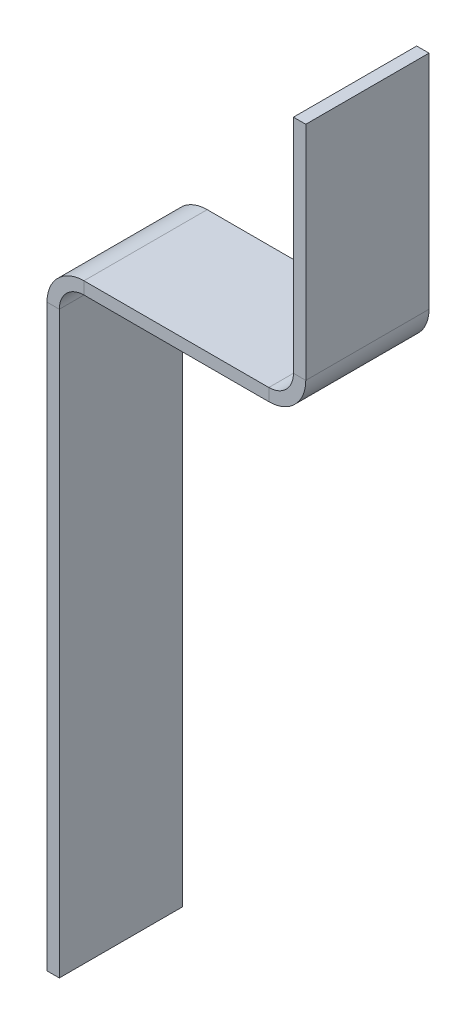
ISO-10303-21;
HEADER;
FILE_DESCRIPTION(('STEP AP214'),'2;1');
FILE_NAME('part.step','',(''),(''),'','','');
FILE_SCHEMA(('AUTOMOTIVE_DESIGN { 1 0 10303 214 1 1 1 1 }'));
ENDSEC;
DATA;
#1=APPLICATION_CONTEXT('core data for automotive mechanical design processes');
#2=APPLICATION_PROTOCOL_DEFINITION('international standard','automotive_design',2000,#1);
#3=PRODUCT_CONTEXT('',#1,'mechanical');
#4=PRODUCT('Part','Part','',(#3));
#5=PRODUCT_RELATED_PRODUCT_CATEGORY('part','',(#4));
#6=PRODUCT_DEFINITION_FORMATION('','',#4);
#7=PRODUCT_DEFINITION_CONTEXT('part definition',#1,'design');
#8=PRODUCT_DEFINITION('design','',#6,#7);
#9=PRODUCT_DEFINITION_SHAPE('','',#8);
#10=(LENGTH_UNIT() NAMED_UNIT(*) SI_UNIT(.MILLI.,.METRE.));
#11=(NAMED_UNIT(*) PLANE_ANGLE_UNIT() SI_UNIT($,.RADIAN.));
#12=(NAMED_UNIT(*) SI_UNIT($,.STERADIAN.) SOLID_ANGLE_UNIT());
#13=UNCERTAINTY_MEASURE_WITH_UNIT(LENGTH_MEASURE(1.E-05),#10,'distance_accuracy_value','');
#14=(GEOMETRIC_REPRESENTATION_CONTEXT(3) GLOBAL_UNCERTAINTY_ASSIGNED_CONTEXT((#13)) GLOBAL_UNIT_ASSIGNED_CONTEXT((#10,
#11,#12)) REPRESENTATION_CONTEXT('',''));
#15=CARTESIAN_POINT('',(0.,0.,0.));
#16=DIRECTION('',(0.,0.,1.));
#17=DIRECTION('',(1.,0.,0.));
#18=AXIS2_PLACEMENT_3D('',#15,#16,#17);
#19=CARTESIAN_POINT('',(0.,49.,5.));
#20=DIRECTION('',(0.,1.,0.));
#21=DIRECTION('',(0.,0.,1.));
#22=AXIS2_PLACEMENT_3D('',#19,#20,#21);
#23=PLANE('',#22);
#24=DIRECTION('',(0.,0.,-1.));
#25=VECTOR('',#24,1.);
#26=CARTESIAN_POINT('',(18.,49.,-5.));
#27=LINE('',#26,#25);
#28=CARTESIAN_POINT('',(18.,49.,-5.));
#29=VERTEX_POINT('',#28);
#30=CARTESIAN_POINT('',(18.,49.,5.));
#31=VERTEX_POINT('',#30);
#32=EDGE_CURVE('E54',#29,#31,#27,.F.);
#33=ORIENTED_EDGE('',*,*,#32,.T.);
#34=DIRECTION('',(1.,0.,0.));
#35=VECTOR('',#34,1.);
#36=CARTESIAN_POINT('',(0.,49.,5.));
#37=LINE('',#36,#35);
#38=CARTESIAN_POINT('',(3.,49.,5.));
#39=VERTEX_POINT('',#38);
#40=EDGE_CURVE('E192',#39,#31,#37,.T.);
#41=ORIENTED_EDGE('',*,*,#40,.F.);
#42=DIRECTION('',(0.,0.,-1.));
#43=VECTOR('',#42,1.);
#44=CARTESIAN_POINT('',(3.,49.,5.));
#45=LINE('',#44,#43);
#46=CARTESIAN_POINT('',(3.,49.,-5.));
#47=VERTEX_POINT('',#46);
#48=EDGE_CURVE('E212',#39,#47,#45,.T.);
#49=ORIENTED_EDGE('',*,*,#48,.T.);
#50=DIRECTION('',(1.,0.,0.));
#51=VECTOR('',#50,1.);
#52=CARTESIAN_POINT('',(0.,49.,-5.));
#53=LINE('',#52,#51);
#54=EDGE_CURVE('E189',#47,#29,#53,.T.);
#55=ORIENTED_EDGE('',*,*,#54,.T.);
#56=EDGE_LOOP('',(#33,#41,#49,#55));
#57=FACE_BOUND('',#56,.T.);
#58=ADVANCED_FACE('F39',(#57),#23,.F.);
#59=CARTESIAN_POINT('',(0.,50.,5.));
#60=DIRECTION('',(0.,1.,0.));
#61=DIRECTION('',(0.,0.,1.));
#62=AXIS2_PLACEMENT_3D('',#59,#60,#61);
#63=PLANE('',#62);
#64=DIRECTION('',(1.,0.,0.));
#65=VECTOR('',#64,1.);
#66=CARTESIAN_POINT('',(0.,50.,5.));
#67=LINE('',#66,#65);
#68=CARTESIAN_POINT('',(3.,50.,5.));
#69=VERTEX_POINT('',#68);
#70=CARTESIAN_POINT('',(18.,50.,5.));
#71=VERTEX_POINT('',#70);
#72=EDGE_CURVE('E194',#69,#71,#67,.T.);
#73=ORIENTED_EDGE('',*,*,#72,.T.);
#74=DIRECTION('',(0.,0.,-1.));
#75=VECTOR('',#74,1.);
#76=CARTESIAN_POINT('',(18.,50.,-5.));
#77=LINE('',#76,#75);
#78=CARTESIAN_POINT('',(18.,50.,-5.));
#79=VERTEX_POINT('',#78);
#80=EDGE_CURVE('E184',#79,#71,#77,.F.);
#81=ORIENTED_EDGE('',*,*,#80,.F.);
#82=DIRECTION('',(1.,0.,0.));
#83=VECTOR('',#82,1.);
#84=CARTESIAN_POINT('',(0.,50.,-5.));
#85=LINE('',#84,#83);
#86=CARTESIAN_POINT('',(3.,50.,-5.));
#87=VERTEX_POINT('',#86);
#88=EDGE_CURVE('E214',#87,#79,#85,.T.);
#89=ORIENTED_EDGE('',*,*,#88,.F.);
#90=DIRECTION('',(0.,0.,-1.));
#91=VECTOR('',#90,1.);
#92=CARTESIAN_POINT('',(3.,50.,5.));
#93=LINE('',#92,#91);
#94=EDGE_CURVE('E242',#69,#87,#93,.T.);
#95=ORIENTED_EDGE('',*,*,#94,.F.);
#96=EDGE_LOOP('',(#73,#81,#89,#95));
#97=FACE_BOUND('',#96,.T.);
#98=ADVANCED_FACE('F304',(#97),#63,.T.);
#99=CARTESIAN_POINT('',(3.,47.,-5.));
#100=DIRECTION('',(0.,0.,1.));
#101=DIRECTION('',(1.,0.,0.));
#102=AXIS2_PLACEMENT_3D('',#99,#100,#101);
#103=PLANE('',#102);
#104=DIRECTION('',(0.,-1.,0.));
#105=VECTOR('',#104,1.);
#106=CARTESIAN_POINT('',(18.,50.,-5.));
#107=LINE('',#106,#105);
#108=EDGE_CURVE('E180',#79,#29,#107,.T.);
#109=ORIENTED_EDGE('',*,*,#108,.T.);
#110=ORIENTED_EDGE('',*,*,#54,.F.);
#111=DIRECTION('',(0.,1.,0.));
#112=VECTOR('',#111,1.);
#113=CARTESIAN_POINT('',(3.,49.,-5.));
#114=LINE('',#113,#112);
#115=EDGE_CURVE('E245',#47,#87,#114,.T.);
#116=ORIENTED_EDGE('',*,*,#115,.T.);
#117=ORIENTED_EDGE('',*,*,#88,.T.);
#118=EDGE_LOOP('',(#109,#110,#116,#117));
#119=FACE_BOUND('',#118,.T.);
#120=ADVANCED_FACE('F309',(#119),#103,.F.);
#121=CARTESIAN_POINT('',(3.,50.,5.));
#122=DIRECTION('',(0.,0.,1.));
#123=DIRECTION('',(1.,0.,0.));
#124=AXIS2_PLACEMENT_3D('',#121,#122,#123);
#125=PLANE('',#124);
#126=DIRECTION('',(0.,-1.,0.));
#127=VECTOR('',#126,1.);
#128=CARTESIAN_POINT('',(3.,50.,5.));
#129=LINE('',#128,#127);
#130=EDGE_CURVE('E11',#69,#39,#129,.T.);
#131=ORIENTED_EDGE('',*,*,#130,.F.);
#132=CARTESIAN_POINT('',(3.,47.,5.));
#133=DIRECTION('',(0.,0.,1.));
#134=DIRECTION('',(1.,0.,0.));
#135=AXIS2_PLACEMENT_3D('',#132,#133,#134);
#136=CIRCLE('',#135,3.);
#137=CARTESIAN_POINT('',(0.,47.,5.));
#138=VERTEX_POINT('',#137);
#139=EDGE_CURVE('E197',#138,#69,#136,.F.);
#140=ORIENTED_EDGE('',*,*,#139,.F.);
#141=DIRECTION('',(-1.,0.,0.));
#142=VECTOR('',#141,1.);
#143=CARTESIAN_POINT('',(1.,47.,5.));
#144=LINE('',#143,#142);
#145=CARTESIAN_POINT('',(1.,47.,5.));
#146=VERTEX_POINT('',#145);
#147=EDGE_CURVE('E47',#146,#138,#144,.T.);
#148=ORIENTED_EDGE('',*,*,#147,.F.);
#149=CARTESIAN_POINT('',(3.,47.,5.));
#150=DIRECTION('',(0.,0.,1.));
#151=DIRECTION('',(1.,0.,0.));
#152=AXIS2_PLACEMENT_3D('',#149,#150,#151);
#153=CIRCLE('',#152,2.);
#154=EDGE_CURVE('E209',#146,#39,#153,.F.);
#155=ORIENTED_EDGE('',*,*,#154,.T.);
#156=EDGE_LOOP('',(#131,#140,#148,#155));
#157=FACE_BOUND('',#156,.T.);
#158=ADVANCED_FACE('F41',(#157),#125,.T.);
#159=CARTESIAN_POINT('',(1.,47.,5.));
#160=DIRECTION('',(0.,0.,1.));
#161=DIRECTION('',(1.,0.,0.));
#162=AXIS2_PLACEMENT_3D('',#159,#160,#161);
#163=PLANE('',#162);
#164=DIRECTION('',(0.,-1.,0.));
#165=VECTOR('',#164,1.);
#166=CARTESIAN_POINT('',(18.,50.,5.));
#167=LINE('',#166,#165);
#168=EDGE_CURVE('E61',#71,#31,#167,.T.);
#169=ORIENTED_EDGE('',*,*,#168,.F.);
#170=ORIENTED_EDGE('',*,*,#72,.F.);
#171=ORIENTED_EDGE('',*,*,#130,.T.);
#172=ORIENTED_EDGE('',*,*,#40,.T.);
#173=EDGE_LOOP('',(#169,#170,#171,#172));
#174=FACE_BOUND('',#173,.T.);
#175=ADVANCED_FACE('F276',(#174),#163,.T.);
#176=CARTESIAN_POINT('',(0.,47.,-5.));
#177=DIRECTION('',(0.,0.,-1.));
#178=DIRECTION('',(-1.,0.,0.));
#179=AXIS2_PLACEMENT_3D('',#176,#177,#178);
#180=PLANE('',#179);
#181=DIRECTION('',(1.,0.,0.));
#182=VECTOR('',#181,1.);
#183=CARTESIAN_POINT('',(0.,47.,-5.));
#184=LINE('',#183,#182);
#185=CARTESIAN_POINT('',(0.,47.,-5.));
#186=VERTEX_POINT('',#185);
#187=CARTESIAN_POINT('',(1.,47.,-5.));
#188=VERTEX_POINT('',#187);
#189=EDGE_CURVE('E247',#186,#188,#184,.T.);
#190=ORIENTED_EDGE('',*,*,#189,.F.);
#191=CARTESIAN_POINT('',(3.,47.,-5.));
#192=DIRECTION('',(0.,0.,1.));
#193=DIRECTION('',(1.,0.,0.));
#194=AXIS2_PLACEMENT_3D('',#191,#192,#193);
#195=CIRCLE('',#194,3.);
#196=EDGE_CURVE('E216',#186,#87,#195,.F.);
#197=ORIENTED_EDGE('',*,*,#196,.T.);
#198=ORIENTED_EDGE('',*,*,#115,.F.);
#199=CARTESIAN_POINT('',(3.,47.,-5.));
#200=DIRECTION('',(0.,0.,1.));
#201=DIRECTION('',(1.,0.,0.));
#202=AXIS2_PLACEMENT_3D('',#199,#200,#201);
#203=CIRCLE('',#202,2.);
#204=EDGE_CURVE('E195',#188,#47,#203,.F.);
#205=ORIENTED_EDGE('',*,*,#204,.F.);
#206=EDGE_LOOP('',(#190,#197,#198,#205));
#207=FACE_BOUND('',#206,.T.);
#208=ADVANCED_FACE('F317',(#207),#180,.T.);
#209=CARTESIAN_POINT('',(3.,49.,-5.));
#210=DIRECTION('',(0.,0.,-1.));
#211=DIRECTION('',(-1.,0.,0.));
#212=AXIS2_PLACEMENT_3D('',#209,#210,#211);
#213=PLANE('',#212);
#214=DIRECTION('',(0.,1.,0.));
#215=VECTOR('',#214,1.);
#216=CARTESIAN_POINT('',(0.,0.,-5.));
#217=LINE('',#216,#215);
#218=CARTESIAN_POINT('',(0.,0.,-5.));
#219=VERTEX_POINT('',#218);
#220=EDGE_CURVE('E219',#219,#186,#217,.T.);
#221=ORIENTED_EDGE('',*,*,#220,.T.);
#222=ORIENTED_EDGE('',*,*,#189,.T.);
#223=DIRECTION('',(0.,1.,0.));
#224=VECTOR('',#223,1.);
#225=CARTESIAN_POINT('',(1.,0.,-5.));
#226=LINE('',#225,#224);
#227=CARTESIAN_POINT('',(1.,0.,-5.));
#228=VERTEX_POINT('',#227);
#229=EDGE_CURVE('E225',#228,#188,#226,.T.);
#230=ORIENTED_EDGE('',*,*,#229,.F.);
#231=DIRECTION('',(-1.,0.,0.));
#232=VECTOR('',#231,1.);
#233=CARTESIAN_POINT('',(1.,0.,-5.));
#234=LINE('',#233,#232);
#235=EDGE_CURVE('E222',#228,#219,#234,.T.);
#236=ORIENTED_EDGE('',*,*,#235,.T.);
#237=EDGE_LOOP('',(#221,#222,#230,#236));
#238=FACE_BOUND('',#237,.T.);
#239=ADVANCED_FACE('F314',(#238),#213,.T.);
#240=CARTESIAN_POINT('',(3.,47.,5.));
#241=DIRECTION('',(0.,0.,-1.));
#242=DIRECTION('',(-1.,0.,0.));
#243=AXIS2_PLACEMENT_3D('',#240,#241,#242);
#244=CYLINDRICAL_SURFACE('',#243,3.);
#245=ORIENTED_EDGE('',*,*,#196,.F.);
#246=DIRECTION('',(0.,0.,-1.));
#247=VECTOR('',#246,1.);
#248=CARTESIAN_POINT('',(0.,47.,5.));
#249=LINE('',#248,#247);
#250=EDGE_CURVE('E239',#138,#186,#249,.T.);
#251=ORIENTED_EDGE('',*,*,#250,.F.);
#252=ORIENTED_EDGE('',*,*,#139,.T.);
#253=ORIENTED_EDGE('',*,*,#94,.T.);
#254=EDGE_LOOP('',(#245,#251,#252,#253));
#255=FACE_BOUND('',#254,.T.);
#256=ADVANCED_FACE('F259',(#255),#244,.T.);
#257=CARTESIAN_POINT('',(0.,0.,5.));
#258=DIRECTION('',(-1.,0.,0.));
#259=DIRECTION('',(0.,0.,1.));
#260=AXIS2_PLACEMENT_3D('',#257,#258,#259);
#261=PLANE('',#260);
#262=ORIENTED_EDGE('',*,*,#220,.F.);
#263=DIRECTION('',(0.,0.,-1.));
#264=VECTOR('',#263,1.);
#265=CARTESIAN_POINT('',(0.,0.,5.));
#266=LINE('',#265,#264);
#267=CARTESIAN_POINT('',(0.,0.,5.));
#268=VERTEX_POINT('',#267);
#269=EDGE_CURVE('E237',#268,#219,#266,.T.);
#270=ORIENTED_EDGE('',*,*,#269,.F.);
#271=DIRECTION('',(0.,1.,0.));
#272=VECTOR('',#271,1.);
#273=CARTESIAN_POINT('',(0.,0.,5.));
#274=LINE('',#273,#272);
#275=EDGE_CURVE('E200',#268,#138,#274,.T.);
#276=ORIENTED_EDGE('',*,*,#275,.T.);
#277=ORIENTED_EDGE('',*,*,#250,.T.);
#278=EDGE_LOOP('',(#262,#270,#276,#277));
#279=FACE_BOUND('',#278,.T.);
#280=ADVANCED_FACE('F263',(#279),#261,.T.);
#281=CARTESIAN_POINT('',(1.,0.,5.));
#282=DIRECTION('',(0.,-1.,0.));
#283=DIRECTION('',(0.,0.,-1.));
#284=AXIS2_PLACEMENT_3D('',#281,#282,#283);
#285=PLANE('',#284);
#286=ORIENTED_EDGE('',*,*,#235,.F.);
#287=DIRECTION('',(0.,0.,-1.));
#288=VECTOR('',#287,1.);
#289=CARTESIAN_POINT('',(1.,0.,5.));
#290=LINE('',#289,#288);
#291=CARTESIAN_POINT('',(1.,0.,5.));
#292=VERTEX_POINT('',#291);
#293=EDGE_CURVE('E235',#292,#228,#290,.T.);
#294=ORIENTED_EDGE('',*,*,#293,.F.);
#295=DIRECTION('',(-1.,0.,0.));
#296=VECTOR('',#295,1.);
#297=CARTESIAN_POINT('',(1.,0.,5.));
#298=LINE('',#297,#296);
#299=EDGE_CURVE('E203',#292,#268,#298,.T.);
#300=ORIENTED_EDGE('',*,*,#299,.T.);
#301=ORIENTED_EDGE('',*,*,#269,.T.);
#302=EDGE_LOOP('',(#286,#294,#300,#301));
#303=FACE_BOUND('',#302,.T.);
#304=ADVANCED_FACE('F266',(#303),#285,.T.);
#305=CARTESIAN_POINT('',(1.,0.,5.));
#306=DIRECTION('',(-1.,0.,0.));
#307=DIRECTION('',(0.,0.,1.));
#308=AXIS2_PLACEMENT_3D('',#305,#306,#307);
#309=PLANE('',#308);
#310=ORIENTED_EDGE('',*,*,#229,.T.);
#311=DIRECTION('',(0.,0.,-1.));
#312=VECTOR('',#311,1.);
#313=CARTESIAN_POINT('',(1.,47.,5.));
#314=LINE('',#313,#312);
#315=EDGE_CURVE('E232',#146,#188,#314,.T.);
#316=ORIENTED_EDGE('',*,*,#315,.F.);
#317=DIRECTION('',(0.,1.,0.));
#318=VECTOR('',#317,1.);
#319=CARTESIAN_POINT('',(1.,0.,5.));
#320=LINE('',#319,#318);
#321=EDGE_CURVE('E206',#292,#146,#320,.T.);
#322=ORIENTED_EDGE('',*,*,#321,.F.);
#323=ORIENTED_EDGE('',*,*,#293,.T.);
#324=EDGE_LOOP('',(#310,#316,#322,#323));
#325=FACE_BOUND('',#324,.T.);
#326=ADVANCED_FACE('F269',(#325),#309,.F.);
#327=CARTESIAN_POINT('',(3.,47.,5.));
#328=DIRECTION('',(0.,0.,-1.));
#329=DIRECTION('',(-1.,0.,0.));
#330=AXIS2_PLACEMENT_3D('',#327,#328,#329);
#331=CYLINDRICAL_SURFACE('',#330,2.);
#332=ORIENTED_EDGE('',*,*,#204,.T.);
#333=ORIENTED_EDGE('',*,*,#48,.F.);
#334=ORIENTED_EDGE('',*,*,#154,.F.);
#335=ORIENTED_EDGE('',*,*,#315,.T.);
#336=EDGE_LOOP('',(#332,#333,#334,#335));
#337=FACE_BOUND('',#336,.T.);
#338=ADVANCED_FACE('F274',(#337),#331,.F.);
#339=CARTESIAN_POINT('',(3.,47.,5.));
#340=DIRECTION('',(0.,0.,1.));
#341=DIRECTION('',(1.,0.,0.));
#342=AXIS2_PLACEMENT_3D('',#339,#340,#341);
#343=PLANE('',#342);
#344=ORIENTED_EDGE('',*,*,#321,.T.);
#345=ORIENTED_EDGE('',*,*,#147,.T.);
#346=ORIENTED_EDGE('',*,*,#275,.F.);
#347=ORIENTED_EDGE('',*,*,#299,.F.);
#348=EDGE_LOOP('',(#344,#345,#346,#347));
#349=FACE_BOUND('',#348,.T.);
#350=ADVANCED_FACE('F251',(#349),#343,.T.);
#351=CARTESIAN_POINT('',(18.,52.,5.));
#352=DIRECTION('',(0.,0.,1.));
#353=DIRECTION('',(1.,0.,0.));
#354=AXIS2_PLACEMENT_3D('',#351,#352,#353);
#355=PLANE('',#354);
#356=DIRECTION('',(1.,0.,0.));
#357=VECTOR('',#356,1.);
#358=CARTESIAN_POINT('',(20.,52.,5.));
#359=LINE('',#358,#357);
#360=CARTESIAN_POINT('',(20.,52.,5.));
#361=VERTEX_POINT('',#360);
#362=CARTESIAN_POINT('',(21.,52.,5.));
#363=VERTEX_POINT('',#362);
#364=EDGE_CURVE('E281',#361,#363,#359,.T.);
#365=ORIENTED_EDGE('',*,*,#364,.F.);
#366=CARTESIAN_POINT('',(18.,52.,5.));
#367=DIRECTION('',(0.,0.,-1.));
#368=DIRECTION('',(-1.,0.,0.));
#369=AXIS2_PLACEMENT_3D('',#366,#367,#368);
#370=CIRCLE('',#369,2.);
#371=EDGE_CURVE('E137',#71,#361,#370,.F.);
#372=ORIENTED_EDGE('',*,*,#371,.F.);
#373=ORIENTED_EDGE('',*,*,#168,.T.);
#374=CARTESIAN_POINT('',(18.,52.,5.));
#375=DIRECTION('',(0.,0.,-1.));
#376=DIRECTION('',(-1.,0.,0.));
#377=AXIS2_PLACEMENT_3D('',#374,#375,#376);
#378=CIRCLE('',#377,3.);
#379=EDGE_CURVE('E179',#31,#363,#378,.F.);
#380=ORIENTED_EDGE('',*,*,#379,.T.);
#381=EDGE_LOOP('',(#365,#372,#373,#380));
#382=FACE_BOUND('',#381,.T.);
#383=ADVANCED_FACE('F279',(#382),#355,.T.);
#384=CARTESIAN_POINT('',(18.,52.,-5.));
#385=DIRECTION('',(0.,0.,1.));
#386=DIRECTION('',(1.,0.,0.));
#387=AXIS2_PLACEMENT_3D('',#384,#385,#386);
#388=PLANE('',#387);
#389=CARTESIAN_POINT('',(18.,52.,-5.));
#390=DIRECTION('',(0.,0.,-1.));
#391=DIRECTION('',(-1.,0.,0.));
#392=AXIS2_PLACEMENT_3D('',#389,#390,#391);
#393=CIRCLE('',#392,2.);
#394=CARTESIAN_POINT('',(20.,52.,-5.));
#395=VERTEX_POINT('',#394);
#396=EDGE_CURVE('E144',#395,#79,#393,.T.);
#397=ORIENTED_EDGE('',*,*,#396,.F.);
#398=DIRECTION('',(1.,0.,0.));
#399=VECTOR('',#398,1.);
#400=CARTESIAN_POINT('',(20.,52.,-5.));
#401=LINE('',#400,#399);
#402=CARTESIAN_POINT('',(21.,52.,-5.));
#403=VERTEX_POINT('',#402);
#404=EDGE_CURVE('E141',#395,#403,#401,.T.);
#405=ORIENTED_EDGE('',*,*,#404,.T.);
#406=CARTESIAN_POINT('',(18.,52.,-5.));
#407=DIRECTION('',(0.,0.,-1.));
#408=DIRECTION('',(-1.,0.,0.));
#409=AXIS2_PLACEMENT_3D('',#406,#407,#408);
#410=CIRCLE('',#409,3.);
#411=EDGE_CURVE('E128',#403,#29,#410,.T.);
#412=ORIENTED_EDGE('',*,*,#411,.T.);
#413=ORIENTED_EDGE('',*,*,#108,.F.);
#414=EDGE_LOOP('',(#397,#405,#412,#413));
#415=FACE_BOUND('',#414,.T.);
#416=ADVANCED_FACE('F142',(#415),#388,.F.);
#417=CARTESIAN_POINT('',(18.,52.,-5.));
#418=DIRECTION('',(0.,0.,-1.));
#419=DIRECTION('',(1.,0.,0.));
#420=AXIS2_PLACEMENT_3D('',#417,#418,#419);
#421=CYLINDRICAL_SURFACE('',#420,3.);
#422=ORIENTED_EDGE('',*,*,#32,.F.);
#423=ORIENTED_EDGE('',*,*,#411,.F.);
#424=DIRECTION('',(0.,0.,1.));
#425=VECTOR('',#424,1.);
#426=CARTESIAN_POINT('',(21.,52.,0.));
#427=LINE('',#426,#425);
#428=EDGE_CURVE('E133',#403,#363,#427,.T.);
#429=ORIENTED_EDGE('',*,*,#428,.T.);
#430=ORIENTED_EDGE('',*,*,#379,.F.);
#431=EDGE_LOOP('',(#422,#423,#429,#430));
#432=FACE_BOUND('',#431,.T.);
#433=ADVANCED_FACE('F130',(#432),#421,.T.);
#434=CARTESIAN_POINT('',(18.,52.,-5.));
#435=DIRECTION('',(0.,0.,-1.));
#436=DIRECTION('',(1.,0.,0.));
#437=AXIS2_PLACEMENT_3D('',#434,#435,#436);
#438=CYLINDRICAL_SURFACE('',#437,2.);
#439=ORIENTED_EDGE('',*,*,#80,.T.);
#440=ORIENTED_EDGE('',*,*,#371,.T.);
#441=DIRECTION('',(0.,0.,-1.));
#442=VECTOR('',#441,1.);
#443=CARTESIAN_POINT('',(20.,52.,5.));
#444=LINE('',#443,#442);
#445=EDGE_CURVE('E148',#361,#395,#444,.T.);
#446=ORIENTED_EDGE('',*,*,#445,.T.);
#447=ORIENTED_EDGE('',*,*,#396,.T.);
#448=EDGE_LOOP('',(#439,#440,#446,#447));
#449=FACE_BOUND('',#448,.T.);
#450=ADVANCED_FACE('F284',(#449),#438,.F.);
#451=CARTESIAN_POINT('',(21.,50.,5.));
#452=DIRECTION('',(0.,0.,-1.));
#453=DIRECTION('',(0.,1.,0.));
#454=AXIS2_PLACEMENT_3D('',#451,#452,#453);
#455=PLANE('',#454);
#456=ORIENTED_EDGE('',*,*,#364,.T.);
#457=DIRECTION('',(0.,-1.,0.));
#458=VECTOR('',#457,1.);
#459=CARTESIAN_POINT('',(21.,50.,5.));
#460=LINE('',#459,#458);
#461=CARTESIAN_POINT('',(21.0000000000001,70.,5.));
#462=VERTEX_POINT('',#461);
#463=EDGE_CURVE('E156',#462,#363,#460,.T.);
#464=ORIENTED_EDGE('',*,*,#463,.F.);
#465=DIRECTION('',(-1.,0.,0.));
#466=VECTOR('',#465,1.);
#467=CARTESIAN_POINT('',(21.0000000000001,70.,5.));
#468=LINE('',#467,#466);
#469=CARTESIAN_POINT('',(20.0000000000001,70.,5.));
#470=VERTEX_POINT('',#469);
#471=EDGE_CURVE('E165',#462,#470,#468,.T.);
#472=ORIENTED_EDGE('',*,*,#471,.T.);
#473=DIRECTION('',(0.,-1.,0.));
#474=VECTOR('',#473,1.);
#475=CARTESIAN_POINT('',(20.,50.,5.));
#476=LINE('',#475,#474);
#477=EDGE_CURVE('E157',#470,#361,#476,.T.);
#478=ORIENTED_EDGE('',*,*,#477,.T.);
#479=EDGE_LOOP('',(#456,#464,#472,#478));
#480=FACE_BOUND('',#479,.T.);
#481=ADVANCED_FACE('F292',(#480),#455,.F.);
#482=CARTESIAN_POINT('',(21.0000000000001,70.,-5.));
#483=DIRECTION('',(0.,0.,1.));
#484=DIRECTION('',(0.,-1.,0.));
#485=AXIS2_PLACEMENT_3D('',#482,#483,#484);
#486=PLANE('',#485);
#487=ORIENTED_EDGE('',*,*,#404,.F.);
#488=DIRECTION('',(0.,1.,0.));
#489=VECTOR('',#488,1.);
#490=CARTESIAN_POINT('',(20.0000000000001,70.,-5.));
#491=LINE('',#490,#489);
#492=CARTESIAN_POINT('',(20.0000000000001,70.,-5.));
#493=VERTEX_POINT('',#492);
#494=EDGE_CURVE('E172',#395,#493,#491,.T.);
#495=ORIENTED_EDGE('',*,*,#494,.T.);
#496=DIRECTION('',(-1.,0.,0.));
#497=VECTOR('',#496,1.);
#498=CARTESIAN_POINT('',(21.0000000000001,70.,-5.));
#499=LINE('',#498,#497);
#500=CARTESIAN_POINT('',(21.0000000000001,70.,-5.));
#501=VERTEX_POINT('',#500);
#502=EDGE_CURVE('E161',#501,#493,#499,.T.);
#503=ORIENTED_EDGE('',*,*,#502,.F.);
#504=DIRECTION('',(0.,1.,0.));
#505=VECTOR('',#504,1.);
#506=CARTESIAN_POINT('',(21.0000000000001,70.,-5.));
#507=LINE('',#506,#505);
#508=EDGE_CURVE('E153',#403,#501,#507,.T.);
#509=ORIENTED_EDGE('',*,*,#508,.F.);
#510=EDGE_LOOP('',(#487,#495,#503,#509));
#511=FACE_BOUND('',#510,.T.);
#512=ADVANCED_FACE('F159',(#511),#486,.F.);
#513=CARTESIAN_POINT('',(20.9999999999998,0.,0.));
#514=DIRECTION('',(-1.,0.,0.));
#515=DIRECTION('',(0.,-1.,0.));
#516=AXIS2_PLACEMENT_3D('',#513,#514,#515);
#517=PLANE('',#516);
#518=ORIENTED_EDGE('',*,*,#428,.F.);
#519=ORIENTED_EDGE('',*,*,#508,.T.);
#520=DIRECTION('',(0.,0.,1.));
#521=VECTOR('',#520,1.);
#522=CARTESIAN_POINT('',(21.0000000000001,70.,5.));
#523=LINE('',#522,#521);
#524=EDGE_CURVE('E163',#501,#462,#523,.T.);
#525=ORIENTED_EDGE('',*,*,#524,.T.);
#526=ORIENTED_EDGE('',*,*,#463,.T.);
#527=EDGE_LOOP('',(#518,#519,#525,#526));
#528=FACE_BOUND('',#527,.T.);
#529=ADVANCED_FACE('F152',(#528),#517,.F.);
#530=CARTESIAN_POINT('',(19.9999999999998,0.,0.));
#531=DIRECTION('',(-1.,0.,0.));
#532=DIRECTION('',(0.,-1.,0.));
#533=AXIS2_PLACEMENT_3D('',#530,#531,#532);
#534=PLANE('',#533);
#535=ORIENTED_EDGE('',*,*,#494,.F.);
#536=ORIENTED_EDGE('',*,*,#445,.F.);
#537=ORIENTED_EDGE('',*,*,#477,.F.);
#538=DIRECTION('',(0.,0.,1.));
#539=VECTOR('',#538,1.);
#540=CARTESIAN_POINT('',(20.0000000000001,70.,5.));
#541=LINE('',#540,#539);
#542=EDGE_CURVE('E167',#493,#470,#541,.T.);
#543=ORIENTED_EDGE('',*,*,#542,.F.);
#544=EDGE_LOOP('',(#535,#536,#537,#543));
#545=FACE_BOUND('',#544,.T.);
#546=ADVANCED_FACE('F288',(#545),#534,.T.);
#547=CARTESIAN_POINT('',(21.0000000000001,70.,5.));
#548=DIRECTION('',(0.,-1.,0.));
#549=DIRECTION('',(1.,0.,0.));
#550=AXIS2_PLACEMENT_3D('',#547,#548,#549);
#551=PLANE('',#550);
#552=ORIENTED_EDGE('',*,*,#542,.T.);
#553=ORIENTED_EDGE('',*,*,#471,.F.);
#554=ORIENTED_EDGE('',*,*,#524,.F.);
#555=ORIENTED_EDGE('',*,*,#502,.T.);
#556=EDGE_LOOP('',(#552,#553,#554,#555));
#557=FACE_BOUND('',#556,.T.);
#558=ADVANCED_FACE('F295',(#557),#551,.F.);
#559=CLOSED_SHELL('',(#58,#98,#120,#158,#175,#208,#239,#256,#280,#304,#326,#338,#350,#383,#416,
#433,#450,#481,#512,#529,#546,#558));
#560=MANIFOLD_SOLID_BREP('B2',#559);
#561=ADVANCED_BREP_SHAPE_REPRESENTATION('',(#18,#560),#14);
#562=SHAPE_DEFINITION_REPRESENTATION(#9,#561);
ENDSEC;
END-ISO-10303-21;
